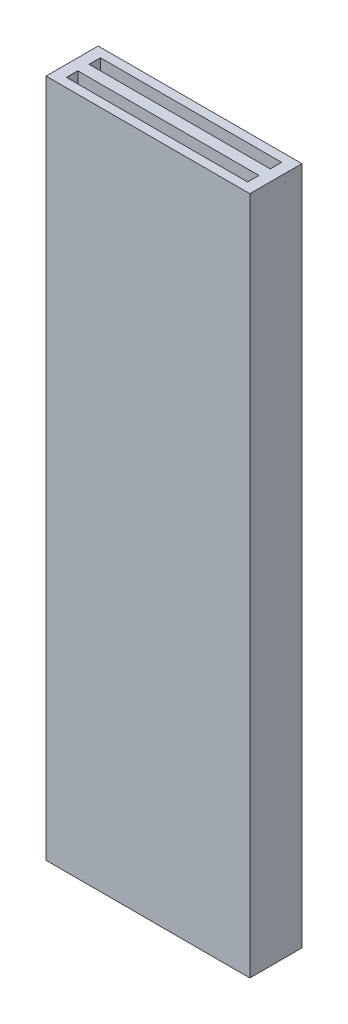
ISO-10303-21;
HEADER;
FILE_DESCRIPTION(('STEP AP214'),'2;1');
FILE_NAME('part.step','',(''),(''),'','','');
FILE_SCHEMA(('AUTOMOTIVE_DESIGN { 1 0 10303 214 1 1 1 1 }'));
ENDSEC;
DATA;
#1=APPLICATION_CONTEXT('core data for automotive mechanical design processes');
#2=APPLICATION_PROTOCOL_DEFINITION('international standard','automotive_design',2000,#1);
#3=PRODUCT_CONTEXT('',#1,'mechanical');
#4=PRODUCT('Part','Part','',(#3));
#5=PRODUCT_RELATED_PRODUCT_CATEGORY('part','',(#4));
#6=PRODUCT_DEFINITION_FORMATION('','',#4);
#7=PRODUCT_DEFINITION_CONTEXT('part definition',#1,'design');
#8=PRODUCT_DEFINITION('design','',#6,#7);
#9=PRODUCT_DEFINITION_SHAPE('','',#8);
#10=(LENGTH_UNIT() NAMED_UNIT(*) SI_UNIT(.MILLI.,.METRE.));
#11=(NAMED_UNIT(*) PLANE_ANGLE_UNIT() SI_UNIT($,.RADIAN.));
#12=(NAMED_UNIT(*) SI_UNIT($,.STERADIAN.) SOLID_ANGLE_UNIT());
#13=UNCERTAINTY_MEASURE_WITH_UNIT(LENGTH_MEASURE(1.E-05),#10,'distance_accuracy_value','');
#14=(GEOMETRIC_REPRESENTATION_CONTEXT(3) GLOBAL_UNCERTAINTY_ASSIGNED_CONTEXT((#13)) GLOBAL_UNIT_ASSIGNED_CONTEXT((#10,
#11,#12)) REPRESENTATION_CONTEXT('',''));
#15=CARTESIAN_POINT('',(0.,0.,0.));
#16=DIRECTION('',(0.,0.,1.));
#17=DIRECTION('',(1.,0.,0.));
#18=AXIS2_PLACEMENT_3D('',#15,#16,#17);
#19=CARTESIAN_POINT('',(0.,15.,0.));
#20=DIRECTION('',(0.,-1.,0.));
#21=DIRECTION('',(0.,0.,-1.));
#22=AXIS2_PLACEMENT_3D('',#19,#20,#21);
#23=PLANE('',#22);
#24=DIRECTION('',(0.,0.,-1.));
#25=VECTOR('',#24,1.);
#26=CARTESIAN_POINT('',(4.5,15.,1.15));
#27=LINE('',#26,#25);
#28=CARTESIAN_POINT('',(4.5,15.,1.15));
#29=VERTEX_POINT('',#28);
#30=CARTESIAN_POINT('',(4.5,15.,-1.15));
#31=VERTEX_POINT('',#30);
#32=EDGE_CURVE('E195',#29,#31,#27,.T.);
#33=ORIENTED_EDGE('',*,*,#32,.T.);
#34=DIRECTION('',(-1.,0.,0.));
#35=VECTOR('',#34,1.);
#36=CARTESIAN_POINT('',(-4.5,15.,-1.15));
#37=LINE('',#36,#35);
#38=CARTESIAN_POINT('',(-4.5,15.,-1.15));
#39=VERTEX_POINT('',#38);
#40=EDGE_CURVE('E198',#31,#39,#37,.T.);
#41=ORIENTED_EDGE('',*,*,#40,.T.);
#42=DIRECTION('',(0.,0.,1.));
#43=VECTOR('',#42,1.);
#44=CARTESIAN_POINT('',(-4.5,15.,1.15));
#45=LINE('',#44,#43);
#46=CARTESIAN_POINT('',(-4.5,15.,1.15));
#47=VERTEX_POINT('',#46);
#48=EDGE_CURVE('E201',#39,#47,#45,.T.);
#49=ORIENTED_EDGE('',*,*,#48,.T.);
#50=DIRECTION('',(1.,0.,0.));
#51=VECTOR('',#50,1.);
#52=CARTESIAN_POINT('',(-4.5,15.,1.15));
#53=LINE('',#52,#51);
#54=EDGE_CURVE('E203',#47,#29,#53,.T.);
#55=ORIENTED_EDGE('',*,*,#54,.T.);
#56=EDGE_LOOP('',(#33,#41,#49,#55));
#57=FACE_BOUND('',#56,.T.);
#58=DIRECTION('',(1.,0.,0.));
#59=VECTOR('',#58,1.);
#60=CARTESIAN_POINT('',(0.,15.,-0.75));
#61=LINE('',#60,#59);
#62=CARTESIAN_POINT('',(-4.,15.,-0.75));
#63=VERTEX_POINT('',#62);
#64=CARTESIAN_POINT('',(4.,15.,-0.75));
#65=VERTEX_POINT('',#64);
#66=EDGE_CURVE('E175',#63,#65,#61,.T.);
#67=ORIENTED_EDGE('',*,*,#66,.T.);
#68=DIRECTION('',(0.,0.,1.));
#69=VECTOR('',#68,1.);
#70=CARTESIAN_POINT('',(4.,15.,0.));
#71=LINE('',#70,#69);
#72=CARTESIAN_POINT('',(4.,15.,-0.25));
#73=VERTEX_POINT('',#72);
#74=EDGE_CURVE('E191',#65,#73,#71,.T.);
#75=ORIENTED_EDGE('',*,*,#74,.T.);
#76=DIRECTION('',(-1.,0.,0.));
#77=VECTOR('',#76,1.);
#78=CARTESIAN_POINT('',(0.,15.,-0.25));
#79=LINE('',#78,#77);
#80=CARTESIAN_POINT('',(-4.,15.,-0.25));
#81=VERTEX_POINT('',#80);
#82=EDGE_CURVE('E188',#73,#81,#79,.T.);
#83=ORIENTED_EDGE('',*,*,#82,.T.);
#84=DIRECTION('',(0.,0.,-1.));
#85=VECTOR('',#84,1.);
#86=CARTESIAN_POINT('',(-4.,15.,0.));
#87=LINE('',#86,#85);
#88=EDGE_CURVE('E185',#81,#63,#87,.T.);
#89=ORIENTED_EDGE('',*,*,#88,.T.);
#90=EDGE_LOOP('',(#67,#75,#83,#89));
#91=FACE_BOUND('',#90,.T.);
#92=DIRECTION('',(0.,0.,-1.));
#93=VECTOR('',#92,1.);
#94=CARTESIAN_POINT('',(4.,15.,0.));
#95=LINE('',#94,#93);
#96=CARTESIAN_POINT('',(4.,15.,0.75));
#97=VERTEX_POINT('',#96);
#98=CARTESIAN_POINT('',(4.,15.,0.25));
#99=VERTEX_POINT('',#98);
#100=EDGE_CURVE('E136',#97,#99,#95,.T.);
#101=ORIENTED_EDGE('',*,*,#100,.F.);
#102=DIRECTION('',(1.,0.,0.));
#103=VECTOR('',#102,1.);
#104=CARTESIAN_POINT('',(0.,15.,0.75));
#105=LINE('',#104,#103);
#106=CARTESIAN_POINT('',(-4.,15.,0.75));
#107=VERTEX_POINT('',#106);
#108=EDGE_CURVE('E156',#107,#97,#105,.T.);
#109=ORIENTED_EDGE('',*,*,#108,.F.);
#110=DIRECTION('',(0.,0.,1.));
#111=VECTOR('',#110,1.);
#112=CARTESIAN_POINT('',(-4.,15.,0.));
#113=LINE('',#112,#111);
#114=CARTESIAN_POINT('',(-4.,15.,0.25));
#115=VERTEX_POINT('',#114);
#116=EDGE_CURVE('E154',#115,#107,#113,.T.);
#117=ORIENTED_EDGE('',*,*,#116,.F.);
#118=DIRECTION('',(-1.,0.,0.));
#119=VECTOR('',#118,1.);
#120=CARTESIAN_POINT('',(0.,15.,0.25));
#121=LINE('',#120,#119);
#122=EDGE_CURVE('E148',#99,#115,#121,.T.);
#123=ORIENTED_EDGE('',*,*,#122,.F.);
#124=EDGE_LOOP('',(#101,#109,#117,#123));
#125=FACE_BOUND('',#124,.T.);
#126=ADVANCED_FACE('F37',(#57,#91,#125),#23,.F.);
#127=CARTESIAN_POINT('',(0.,-15.,0.));
#128=DIRECTION('',(0.,-1.,0.));
#129=DIRECTION('',(0.,0.,-1.));
#130=AXIS2_PLACEMENT_3D('',#127,#128,#129);
#131=PLANE('',#130);
#132=DIRECTION('',(0.,0.,-1.));
#133=VECTOR('',#132,1.);
#134=CARTESIAN_POINT('',(4.,-15.,-0.25));
#135=LINE('',#134,#133);
#136=CARTESIAN_POINT('',(4.,-15.,-0.25));
#137=VERTEX_POINT('',#136);
#138=CARTESIAN_POINT('',(4.,-15.,-0.75));
#139=VERTEX_POINT('',#138);
#140=EDGE_CURVE('E159',#137,#139,#135,.T.);
#141=ORIENTED_EDGE('',*,*,#140,.T.);
#142=DIRECTION('',(-1.,0.,0.));
#143=VECTOR('',#142,1.);
#144=CARTESIAN_POINT('',(-4.,-15.,-0.75));
#145=LINE('',#144,#143);
#146=CARTESIAN_POINT('',(-4.,-15.,-0.75));
#147=VERTEX_POINT('',#146);
#148=EDGE_CURVE('E162',#139,#147,#145,.T.);
#149=ORIENTED_EDGE('',*,*,#148,.T.);
#150=DIRECTION('',(0.,0.,1.));
#151=VECTOR('',#150,1.);
#152=CARTESIAN_POINT('',(-4.,-15.,-0.25));
#153=LINE('',#152,#151);
#154=CARTESIAN_POINT('',(-4.,-15.,-0.25));
#155=VERTEX_POINT('',#154);
#156=EDGE_CURVE('E165',#147,#155,#153,.T.);
#157=ORIENTED_EDGE('',*,*,#156,.T.);
#158=DIRECTION('',(1.,0.,0.));
#159=VECTOR('',#158,1.);
#160=CARTESIAN_POINT('',(-4.,-15.,-0.25));
#161=LINE('',#160,#159);
#162=EDGE_CURVE('E168',#155,#137,#161,.T.);
#163=ORIENTED_EDGE('',*,*,#162,.T.);
#164=EDGE_LOOP('',(#141,#149,#157,#163));
#165=FACE_BOUND('',#164,.T.);
#166=DIRECTION('',(0.,0.,-1.));
#167=VECTOR('',#166,1.);
#168=CARTESIAN_POINT('',(4.5,-15.,1.15));
#169=LINE('',#168,#167);
#170=CARTESIAN_POINT('',(4.5,-15.,1.15));
#171=VERTEX_POINT('',#170);
#172=CARTESIAN_POINT('',(4.5,-15.,-1.15));
#173=VERTEX_POINT('',#172);
#174=EDGE_CURVE('E194',#171,#173,#169,.T.);
#175=ORIENTED_EDGE('',*,*,#174,.F.);
#176=DIRECTION('',(1.,0.,0.));
#177=VECTOR('',#176,1.);
#178=CARTESIAN_POINT('',(-4.5,-15.,1.15));
#179=LINE('',#178,#177);
#180=CARTESIAN_POINT('',(-4.5,-15.,1.15));
#181=VERTEX_POINT('',#180);
#182=EDGE_CURVE('E199',#181,#171,#179,.T.);
#183=ORIENTED_EDGE('',*,*,#182,.F.);
#184=DIRECTION('',(0.,0.,1.));
#185=VECTOR('',#184,1.);
#186=CARTESIAN_POINT('',(-4.5,-15.,1.15));
#187=LINE('',#186,#185);
#188=CARTESIAN_POINT('',(-4.5,-15.,-1.15));
#189=VERTEX_POINT('',#188);
#190=EDGE_CURVE('E210',#189,#181,#187,.T.);
#191=ORIENTED_EDGE('',*,*,#190,.F.);
#192=DIRECTION('',(-1.,0.,0.));
#193=VECTOR('',#192,1.);
#194=CARTESIAN_POINT('',(-4.5,-15.,-1.15));
#195=LINE('',#194,#193);
#196=EDGE_CURVE('E208',#173,#189,#195,.T.);
#197=ORIENTED_EDGE('',*,*,#196,.F.);
#198=EDGE_LOOP('',(#175,#183,#191,#197));
#199=FACE_BOUND('',#198,.T.);
#200=DIRECTION('',(-1.,0.,0.));
#201=VECTOR('',#200,1.);
#202=CARTESIAN_POINT('',(-4.,-15.,0.75));
#203=LINE('',#202,#201);
#204=CARTESIAN_POINT('',(4.,-15.,0.75));
#205=VERTEX_POINT('',#204);
#206=CARTESIAN_POINT('',(-4.,-15.,0.75));
#207=VERTEX_POINT('',#206);
#208=EDGE_CURVE('E138',#205,#207,#203,.T.);
#209=ORIENTED_EDGE('',*,*,#208,.F.);
#210=DIRECTION('',(0.,0.,1.));
#211=VECTOR('',#210,1.);
#212=CARTESIAN_POINT('',(4.,-15.,0.25));
#213=LINE('',#212,#211);
#214=CARTESIAN_POINT('',(4.,-15.,0.25));
#215=VERTEX_POINT('',#214);
#216=EDGE_CURVE('E129',#215,#205,#213,.T.);
#217=ORIENTED_EDGE('',*,*,#216,.F.);
#218=DIRECTION('',(1.,0.,0.));
#219=VECTOR('',#218,1.);
#220=CARTESIAN_POINT('',(-4.,-15.,0.25));
#221=LINE('',#220,#219);
#222=CARTESIAN_POINT('',(-4.,-15.,0.25));
#223=VERTEX_POINT('',#222);
#224=EDGE_CURVE('E123',#223,#215,#221,.T.);
#225=ORIENTED_EDGE('',*,*,#224,.F.);
#226=DIRECTION('',(0.,0.,-1.));
#227=VECTOR('',#226,1.);
#228=CARTESIAN_POINT('',(-4.,-15.,0.25));
#229=LINE('',#228,#227);
#230=EDGE_CURVE('E128',#207,#223,#229,.T.);
#231=ORIENTED_EDGE('',*,*,#230,.F.);
#232=EDGE_LOOP('',(#209,#217,#225,#231));
#233=FACE_BOUND('',#232,.T.);
#234=ADVANCED_FACE('F141',(#165,#199,#233),#131,.T.);
#235=CARTESIAN_POINT('',(4.5,15.,1.15));
#236=DIRECTION('',(-1.,0.,0.));
#237=DIRECTION('',(0.,0.,1.));
#238=AXIS2_PLACEMENT_3D('',#235,#236,#237);
#239=PLANE('',#238);
#240=ORIENTED_EDGE('',*,*,#174,.T.);
#241=DIRECTION('',(0.,-1.,0.));
#242=VECTOR('',#241,1.);
#243=CARTESIAN_POINT('',(4.5,15.,-1.15));
#244=LINE('',#243,#242);
#245=EDGE_CURVE('E11',#31,#173,#244,.T.);
#246=ORIENTED_EDGE('',*,*,#245,.F.);
#247=ORIENTED_EDGE('',*,*,#32,.F.);
#248=DIRECTION('',(0.,-1.,0.));
#249=VECTOR('',#248,1.);
#250=CARTESIAN_POINT('',(4.5,15.,1.15));
#251=LINE('',#250,#249);
#252=EDGE_CURVE('E205',#29,#171,#251,.T.);
#253=ORIENTED_EDGE('',*,*,#252,.T.);
#254=EDGE_LOOP('',(#240,#246,#247,#253));
#255=FACE_BOUND('',#254,.T.);
#256=ADVANCED_FACE('F39',(#255),#239,.F.);
#257=CARTESIAN_POINT('',(-4.5,15.,-1.15));
#258=DIRECTION('',(0.,0.,1.));
#259=DIRECTION('',(1.,0.,0.));
#260=AXIS2_PLACEMENT_3D('',#257,#258,#259);
#261=PLANE('',#260);
#262=ORIENTED_EDGE('',*,*,#196,.T.);
#263=DIRECTION('',(0.,-1.,0.));
#264=VECTOR('',#263,1.);
#265=CARTESIAN_POINT('',(-4.5,15.,-1.15));
#266=LINE('',#265,#264);
#267=EDGE_CURVE('E45',#39,#189,#266,.T.);
#268=ORIENTED_EDGE('',*,*,#267,.F.);
#269=ORIENTED_EDGE('',*,*,#40,.F.);
#270=ORIENTED_EDGE('',*,*,#245,.T.);
#271=EDGE_LOOP('',(#262,#268,#269,#270));
#272=FACE_BOUND('',#271,.T.);
#273=ADVANCED_FACE('F237',(#272),#261,.F.);
#274=CARTESIAN_POINT('',(-4.5,15.,1.15));
#275=DIRECTION('',(1.,0.,0.));
#276=DIRECTION('',(0.,0.,-1.));
#277=AXIS2_PLACEMENT_3D('',#274,#275,#276);
#278=PLANE('',#277);
#279=ORIENTED_EDGE('',*,*,#190,.T.);
#280=DIRECTION('',(0.,-1.,0.));
#281=VECTOR('',#280,1.);
#282=CARTESIAN_POINT('',(-4.5,15.,1.15));
#283=LINE('',#282,#281);
#284=EDGE_CURVE('E215',#47,#181,#283,.T.);
#285=ORIENTED_EDGE('',*,*,#284,.F.);
#286=ORIENTED_EDGE('',*,*,#48,.F.);
#287=ORIENTED_EDGE('',*,*,#267,.T.);
#288=EDGE_LOOP('',(#279,#285,#286,#287));
#289=FACE_BOUND('',#288,.T.);
#290=ADVANCED_FACE('F222',(#289),#278,.F.);
#291=CARTESIAN_POINT('',(-4.5,15.,1.15));
#292=DIRECTION('',(0.,0.,-1.));
#293=DIRECTION('',(-1.,0.,0.));
#294=AXIS2_PLACEMENT_3D('',#291,#292,#293);
#295=PLANE('',#294);
#296=ORIENTED_EDGE('',*,*,#182,.T.);
#297=ORIENTED_EDGE('',*,*,#252,.F.);
#298=ORIENTED_EDGE('',*,*,#54,.F.);
#299=ORIENTED_EDGE('',*,*,#284,.T.);
#300=EDGE_LOOP('',(#296,#297,#298,#299));
#301=FACE_BOUND('',#300,.T.);
#302=ADVANCED_FACE('F230',(#301),#295,.F.);
#303=CARTESIAN_POINT('',(4.,-15.,-0.25));
#304=DIRECTION('',(1.,0.,0.));
#305=DIRECTION('',(0.,0.,-1.));
#306=AXIS2_PLACEMENT_3D('',#303,#304,#305);
#307=PLANE('',#306);
#308=DIRECTION('',(0.,1.,0.));
#309=VECTOR('',#308,1.);
#310=CARTESIAN_POINT('',(4.,-15.,-0.75));
#311=LINE('',#310,#309);
#312=EDGE_CURVE('E171',#139,#65,#311,.T.);
#313=ORIENTED_EDGE('',*,*,#312,.F.);
#314=ORIENTED_EDGE('',*,*,#140,.F.);
#315=DIRECTION('',(0.,1.,0.));
#316=VECTOR('',#315,1.);
#317=CARTESIAN_POINT('',(4.,-15.,-0.25));
#318=LINE('',#317,#316);
#319=EDGE_CURVE('E172',#137,#73,#318,.T.);
#320=ORIENTED_EDGE('',*,*,#319,.T.);
#321=ORIENTED_EDGE('',*,*,#74,.F.);
#322=EDGE_LOOP('',(#313,#314,#320,#321));
#323=FACE_BOUND('',#322,.T.);
#324=ADVANCED_FACE('F252',(#323),#307,.F.);
#325=CARTESIAN_POINT('',(-4.,-15.,-0.25));
#326=DIRECTION('',(0.,0.,1.));
#327=DIRECTION('',(1.,0.,0.));
#328=AXIS2_PLACEMENT_3D('',#325,#326,#327);
#329=PLANE('',#328);
#330=ORIENTED_EDGE('',*,*,#319,.F.);
#331=ORIENTED_EDGE('',*,*,#162,.F.);
#332=DIRECTION('',(0.,1.,0.));
#333=VECTOR('',#332,1.);
#334=CARTESIAN_POINT('',(-4.,-15.,-0.25));
#335=LINE('',#334,#333);
#336=EDGE_CURVE('E176',#155,#81,#335,.T.);
#337=ORIENTED_EDGE('',*,*,#336,.T.);
#338=ORIENTED_EDGE('',*,*,#82,.F.);
#339=EDGE_LOOP('',(#330,#331,#337,#338));
#340=FACE_BOUND('',#339,.T.);
#341=ADVANCED_FACE('F259',(#340),#329,.F.);
#342=CARTESIAN_POINT('',(-4.,-15.,-0.25));
#343=DIRECTION('',(-1.,0.,0.));
#344=DIRECTION('',(0.,0.,1.));
#345=AXIS2_PLACEMENT_3D('',#342,#343,#344);
#346=PLANE('',#345);
#347=ORIENTED_EDGE('',*,*,#336,.F.);
#348=ORIENTED_EDGE('',*,*,#156,.F.);
#349=DIRECTION('',(0.,1.,0.));
#350=VECTOR('',#349,1.);
#351=CARTESIAN_POINT('',(-4.,-15.,-0.75));
#352=LINE('',#351,#350);
#353=EDGE_CURVE('E179',#147,#63,#352,.T.);
#354=ORIENTED_EDGE('',*,*,#353,.T.);
#355=ORIENTED_EDGE('',*,*,#88,.F.);
#356=EDGE_LOOP('',(#347,#348,#354,#355));
#357=FACE_BOUND('',#356,.T.);
#358=ADVANCED_FACE('F264',(#357),#346,.F.);
#359=CARTESIAN_POINT('',(-4.,-15.,-0.75));
#360=DIRECTION('',(0.,0.,-1.));
#361=DIRECTION('',(-1.,0.,0.));
#362=AXIS2_PLACEMENT_3D('',#359,#360,#361);
#363=PLANE('',#362);
#364=ORIENTED_EDGE('',*,*,#353,.F.);
#365=ORIENTED_EDGE('',*,*,#148,.F.);
#366=ORIENTED_EDGE('',*,*,#312,.T.);
#367=ORIENTED_EDGE('',*,*,#66,.F.);
#368=EDGE_LOOP('',(#364,#365,#366,#367));
#369=FACE_BOUND('',#368,.T.);
#370=ADVANCED_FACE('F272',(#369),#363,.F.);
#371=CARTESIAN_POINT('',(4.,-15.,0.25));
#372=DIRECTION('',(-1.,0.,0.));
#373=DIRECTION('',(0.,0.,1.));
#374=AXIS2_PLACEMENT_3D('',#371,#372,#373);
#375=PLANE('',#374);
#376=ORIENTED_EDGE('',*,*,#100,.T.);
#377=DIRECTION('',(0.,1.,0.));
#378=VECTOR('',#377,1.);
#379=CARTESIAN_POINT('',(4.,-15.,0.25));
#380=LINE('',#379,#378);
#381=EDGE_CURVE('E52',#215,#99,#380,.T.);
#382=ORIENTED_EDGE('',*,*,#381,.F.);
#383=ORIENTED_EDGE('',*,*,#216,.T.);
#384=DIRECTION('',(0.,1.,0.));
#385=VECTOR('',#384,1.);
#386=CARTESIAN_POINT('',(4.,-15.,0.75));
#387=LINE('',#386,#385);
#388=EDGE_CURVE('E146',#205,#97,#387,.T.);
#389=ORIENTED_EDGE('',*,*,#388,.T.);
#390=EDGE_LOOP('',(#376,#382,#383,#389));
#391=FACE_BOUND('',#390,.T.);
#392=ADVANCED_FACE('F132',(#391),#375,.T.);
#393=CARTESIAN_POINT('',(-4.,-15.,0.75));
#394=DIRECTION('',(0.,0.,-1.));
#395=DIRECTION('',(-1.,0.,0.));
#396=AXIS2_PLACEMENT_3D('',#393,#394,#395);
#397=PLANE('',#396);
#398=ORIENTED_EDGE('',*,*,#108,.T.);
#399=ORIENTED_EDGE('',*,*,#388,.F.);
#400=ORIENTED_EDGE('',*,*,#208,.T.);
#401=DIRECTION('',(0.,1.,0.));
#402=VECTOR('',#401,1.);
#403=CARTESIAN_POINT('',(-4.,-15.,0.75));
#404=LINE('',#403,#402);
#405=EDGE_CURVE('E149',#207,#107,#404,.T.);
#406=ORIENTED_EDGE('',*,*,#405,.T.);
#407=EDGE_LOOP('',(#398,#399,#400,#406));
#408=FACE_BOUND('',#407,.T.);
#409=ADVANCED_FACE('F284',(#408),#397,.T.);
#410=CARTESIAN_POINT('',(-4.,-15.,0.25));
#411=DIRECTION('',(1.,0.,0.));
#412=DIRECTION('',(0.,0.,-1.));
#413=AXIS2_PLACEMENT_3D('',#410,#411,#412);
#414=PLANE('',#413);
#415=ORIENTED_EDGE('',*,*,#116,.T.);
#416=ORIENTED_EDGE('',*,*,#405,.F.);
#417=ORIENTED_EDGE('',*,*,#230,.T.);
#418=DIRECTION('',(0.,1.,0.));
#419=VECTOR('',#418,1.);
#420=CARTESIAN_POINT('',(-4.,-15.,0.25));
#421=LINE('',#420,#419);
#422=EDGE_CURVE('E57',#223,#115,#421,.T.);
#423=ORIENTED_EDGE('',*,*,#422,.T.);
#424=EDGE_LOOP('',(#415,#416,#417,#423));
#425=FACE_BOUND('',#424,.T.);
#426=ADVANCED_FACE('F287',(#425),#414,.T.);
#427=CARTESIAN_POINT('',(-4.,-15.,0.25));
#428=DIRECTION('',(0.,0.,1.));
#429=DIRECTION('',(1.,0.,0.));
#430=AXIS2_PLACEMENT_3D('',#427,#428,#429);
#431=PLANE('',#430);
#432=ORIENTED_EDGE('',*,*,#122,.T.);
#433=ORIENTED_EDGE('',*,*,#422,.F.);
#434=ORIENTED_EDGE('',*,*,#224,.T.);
#435=ORIENTED_EDGE('',*,*,#381,.T.);
#436=EDGE_LOOP('',(#432,#433,#434,#435));
#437=FACE_BOUND('',#436,.T.);
#438=ADVANCED_FACE('F124',(#437),#431,.T.);
#439=CLOSED_SHELL('',(#126,#234,#256,#273,#290,#302,#324,#341,#358,#370,#392,#409,#426,#438));
#440=MANIFOLD_SOLID_BREP('B2',#439);
#441=ADVANCED_BREP_SHAPE_REPRESENTATION('',(#18,#440),#14);
#442=SHAPE_DEFINITION_REPRESENTATION(#9,#441);
ENDSEC;
END-ISO-10303-21;
